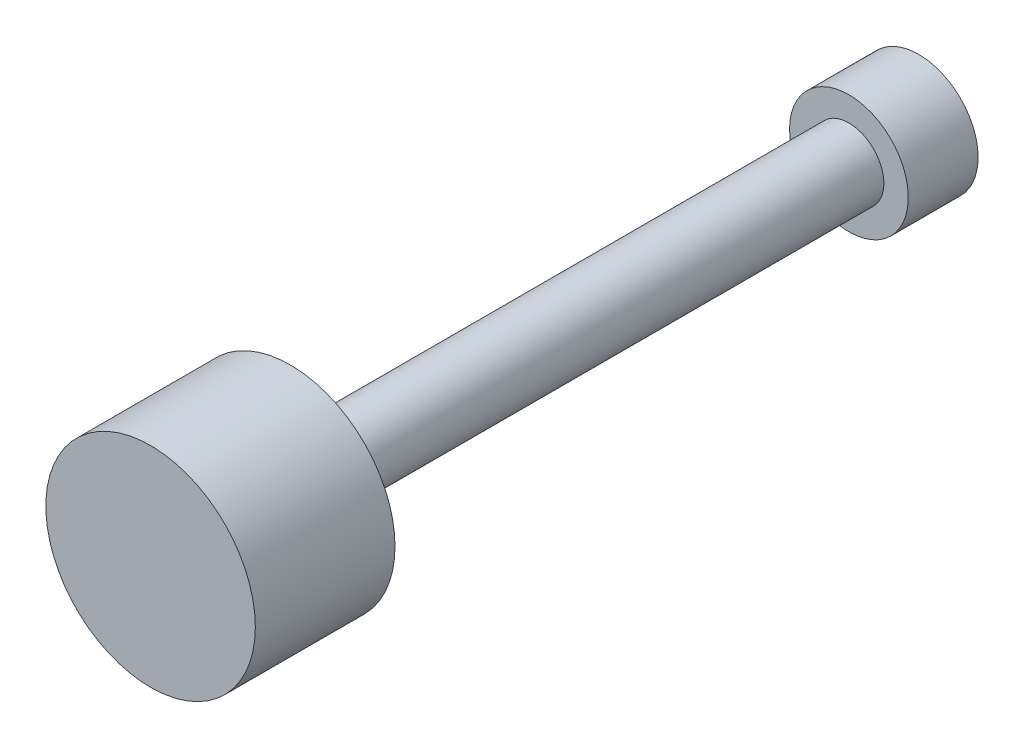
ISO-10303-21;
HEADER;
FILE_DESCRIPTION(('STEP AP214'),'2;1');
FILE_NAME('part.step','',(''),(''),'','','');
FILE_SCHEMA(('AUTOMOTIVE_DESIGN { 1 0 10303 214 1 1 1 1 }'));
ENDSEC;
DATA;
#1=APPLICATION_CONTEXT('core data for automotive mechanical design processes');
#2=APPLICATION_PROTOCOL_DEFINITION('international standard','automotive_design',2000,#1);
#3=PRODUCT_CONTEXT('',#1,'mechanical');
#4=PRODUCT('Part','Part','',(#3));
#5=PRODUCT_RELATED_PRODUCT_CATEGORY('part','',(#4));
#6=PRODUCT_DEFINITION_FORMATION('','',#4);
#7=PRODUCT_DEFINITION_CONTEXT('part definition',#1,'design');
#8=PRODUCT_DEFINITION('design','',#6,#7);
#9=PRODUCT_DEFINITION_SHAPE('','',#8);
#10=(LENGTH_UNIT() NAMED_UNIT(*) SI_UNIT(.MILLI.,.METRE.));
#11=(NAMED_UNIT(*) PLANE_ANGLE_UNIT() SI_UNIT($,.RADIAN.));
#12=(NAMED_UNIT(*) SI_UNIT($,.STERADIAN.) SOLID_ANGLE_UNIT());
#13=UNCERTAINTY_MEASURE_WITH_UNIT(LENGTH_MEASURE(1.E-05),#10,'distance_accuracy_value','');
#14=(GEOMETRIC_REPRESENTATION_CONTEXT(3) GLOBAL_UNCERTAINTY_ASSIGNED_CONTEXT((#13)) GLOBAL_UNIT_ASSIGNED_CONTEXT((#10,
#11,#12)) REPRESENTATION_CONTEXT('',''));
#15=CARTESIAN_POINT('',(0.,0.,0.));
#16=DIRECTION('',(0.,0.,1.));
#17=DIRECTION('',(1.,0.,0.));
#18=AXIS2_PLACEMENT_3D('',#15,#16,#17);
#19=CARTESIAN_POINT('',(0.,0.,1000.));
#20=DIRECTION('',(0.,0.,-1.));
#21=DIRECTION('',(-1.,0.,0.));
#22=AXIS2_PLACEMENT_3D('',#19,#20,#21);
#23=CYLINDRICAL_SURFACE('',#22,50.);
#24=CARTESIAN_POINT('',(0.,0.,0.));
#25=DIRECTION('',(0.,0.,-1.));
#26=DIRECTION('',(-1.,0.,0.));
#27=AXIS2_PLACEMENT_3D('',#24,#25,#26);
#28=CIRCLE('',#27,50.);
#29=CARTESIAN_POINT('',(-50.,0.,0.));
#30=VERTEX_POINT('',#29);
#31=EDGE_CURVE('E46',#30,#30,#28,.T.);
#32=ORIENTED_EDGE('',*,*,#31,.F.);
#33=EDGE_LOOP('',(#32));
#34=FACE_BOUND('',#33,.T.);
#35=CARTESIAN_POINT('',(0.,0.,800.));
#36=DIRECTION('',(0.,0.,1.));
#37=DIRECTION('',(1.,0.,0.));
#38=AXIS2_PLACEMENT_3D('',#35,#36,#37);
#39=CIRCLE('',#38,50.);
#40=CARTESIAN_POINT('',(50.,0.,800.));
#41=VERTEX_POINT('',#40);
#42=EDGE_CURVE('E10',#41,#41,#39,.T.);
#43=ORIENTED_EDGE('',*,*,#42,.F.);
#44=EDGE_LOOP('',(#43));
#45=FACE_BOUND('',#44,.T.);
#46=ADVANCED_FACE('F31',(#34,#45),#23,.T.);
#47=CARTESIAN_POINT('',(0.,0.,800.));
#48=DIRECTION('',(0.,0.,1.));
#49=DIRECTION('',(1.,0.,0.));
#50=AXIS2_PLACEMENT_3D('',#47,#48,#49);
#51=PLANE('',#50);
#52=CARTESIAN_POINT('',(0.,0.,800.));
#53=DIRECTION('',(0.,0.,1.));
#54=DIRECTION('',(1.,0.,0.));
#55=AXIS2_PLACEMENT_3D('',#52,#53,#54);
#56=CIRCLE('',#55,150.);
#57=CARTESIAN_POINT('',(150.,0.,800.));
#58=VERTEX_POINT('',#57);
#59=EDGE_CURVE('E37',#58,#58,#56,.T.);
#60=ORIENTED_EDGE('',*,*,#59,.F.);
#61=EDGE_LOOP('',(#60));
#62=FACE_BOUND('',#61,.T.);
#63=ORIENTED_EDGE('',*,*,#42,.T.);
#64=EDGE_LOOP('',(#63));
#65=FACE_BOUND('',#64,.T.);
#66=ADVANCED_FACE('F74',(#62,#65),#51,.F.);
#67=CARTESIAN_POINT('',(0.,0.,800.));
#68=DIRECTION('',(0.,0.,1.));
#69=DIRECTION('',(1.,0.,0.));
#70=AXIS2_PLACEMENT_3D('',#67,#68,#69);
#71=CYLINDRICAL_SURFACE('',#70,150.);
#72=ORIENTED_EDGE('',*,*,#59,.T.);
#73=EDGE_LOOP('',(#72));
#74=FACE_BOUND('',#73,.T.);
#75=CARTESIAN_POINT('',(0.,0.,1000.));
#76=DIRECTION('',(0.,0.,1.));
#77=DIRECTION('',(1.,0.,0.));
#78=AXIS2_PLACEMENT_3D('',#75,#76,#77);
#79=CIRCLE('',#78,150.);
#80=CARTESIAN_POINT('',(150.,0.,1000.));
#81=VERTEX_POINT('',#80);
#82=EDGE_CURVE('E41',#81,#81,#79,.T.);
#83=ORIENTED_EDGE('',*,*,#82,.F.);
#84=EDGE_LOOP('',(#83));
#85=FACE_BOUND('',#84,.T.);
#86=ADVANCED_FACE('F78',(#74,#85),#71,.T.);
#87=CARTESIAN_POINT('',(0.,0.,1000.));
#88=DIRECTION('',(0.,0.,1.));
#89=DIRECTION('',(1.,0.,0.));
#90=AXIS2_PLACEMENT_3D('',#87,#88,#89);
#91=PLANE('',#90);
#92=ORIENTED_EDGE('',*,*,#82,.T.);
#93=EDGE_LOOP('',(#92));
#94=FACE_BOUND('',#93,.T.);
#95=ADVANCED_FACE('F68',(#94),#91,.T.);
#96=CARTESIAN_POINT('',(0.,0.,0.));
#97=DIRECTION('',(0.,0.,-1.));
#98=DIRECTION('',(-1.,0.,0.));
#99=AXIS2_PLACEMENT_3D('',#96,#97,#98);
#100=PLANE('',#99);
#101=CARTESIAN_POINT('',(0.,0.,0.));
#102=DIRECTION('',(0.,0.,-1.));
#103=DIRECTION('',(-1.,0.,0.));
#104=AXIS2_PLACEMENT_3D('',#101,#102,#103);
#105=CIRCLE('',#104,85.);
#106=CARTESIAN_POINT('',(-85.,0.,0.));
#107=VERTEX_POINT('',#106);
#108=EDGE_CURVE('E51',#107,#107,#105,.T.);
#109=ORIENTED_EDGE('',*,*,#108,.F.);
#110=EDGE_LOOP('',(#109));
#111=FACE_BOUND('',#110,.T.);
#112=ORIENTED_EDGE('',*,*,#31,.T.);
#113=EDGE_LOOP('',(#112));
#114=FACE_BOUND('',#113,.T.);
#115=ADVANCED_FACE('F62',(#111,#114),#100,.F.);
#116=CARTESIAN_POINT('',(0.,0.,-100.));
#117=DIRECTION('',(0.,0.,1.));
#118=DIRECTION('',(1.,0.,0.));
#119=AXIS2_PLACEMENT_3D('',#116,#117,#118);
#120=CYLINDRICAL_SURFACE('',#119,85.);
#121=CARTESIAN_POINT('',(0.,0.,-100.));
#122=DIRECTION('',(0.,0.,-1.));
#123=DIRECTION('',(-1.,0.,0.));
#124=AXIS2_PLACEMENT_3D('',#121,#122,#123);
#125=CIRCLE('',#124,85.);
#126=CARTESIAN_POINT('',(-85.,0.,-100.));
#127=VERTEX_POINT('',#126);
#128=EDGE_CURVE('E50',#127,#127,#125,.T.);
#129=ORIENTED_EDGE('',*,*,#128,.F.);
#130=EDGE_LOOP('',(#129));
#131=FACE_BOUND('',#130,.T.);
#132=ORIENTED_EDGE('',*,*,#108,.T.);
#133=EDGE_LOOP('',(#132));
#134=FACE_BOUND('',#133,.T.);
#135=ADVANCED_FACE('F59',(#131,#134),#120,.T.);
#136=CARTESIAN_POINT('',(0.,0.,-100.));
#137=DIRECTION('',(0.,0.,-1.));
#138=DIRECTION('',(-1.,0.,0.));
#139=AXIS2_PLACEMENT_3D('',#136,#137,#138);
#140=PLANE('',#139);
#141=ORIENTED_EDGE('',*,*,#128,.T.);
#142=EDGE_LOOP('',(#141));
#143=FACE_BOUND('',#142,.T.);
#144=ADVANCED_FACE('F57',(#143),#140,.T.);
#145=CLOSED_SHELL('',(#46,#66,#86,#95,#115,#135,#144));
#146=MANIFOLD_SOLID_BREP('B2',#145);
#147=ADVANCED_BREP_SHAPE_REPRESENTATION('',(#18,#146),#14);
#148=SHAPE_DEFINITION_REPRESENTATION(#9,#147);
ENDSEC;
END-ISO-10303-21;
